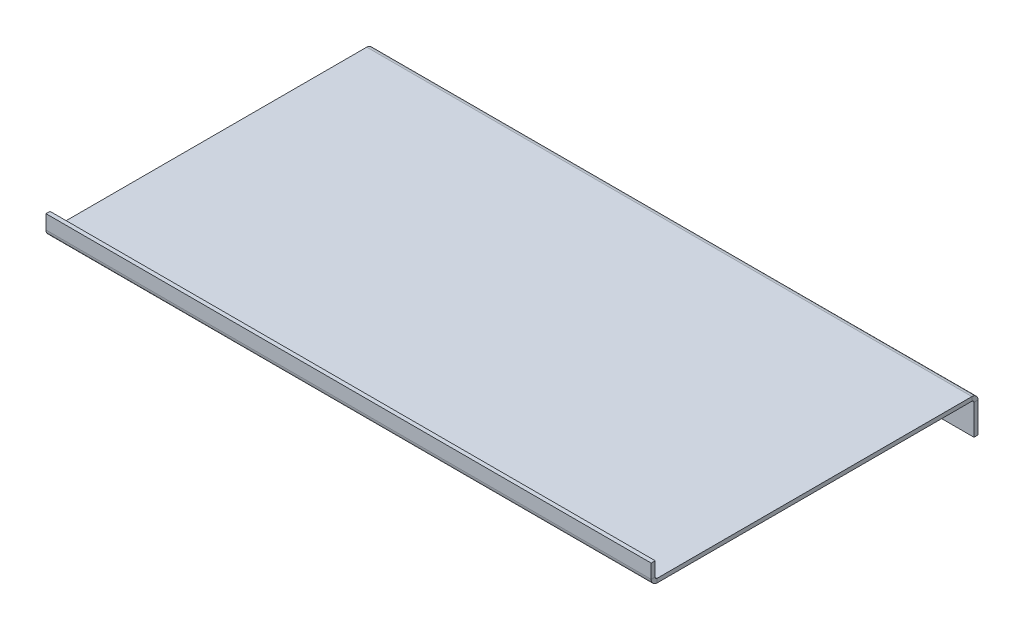
ISO-10303-21;
HEADER;
FILE_DESCRIPTION(('STEP AP214'),'2;1');
FILE_NAME('part.step','',(''),(''),'','','');
FILE_SCHEMA(('AUTOMOTIVE_DESIGN { 1 0 10303 214 1 1 1 1 }'));
ENDSEC;
DATA;
#1=APPLICATION_CONTEXT('core data for automotive mechanical design processes');
#2=APPLICATION_PROTOCOL_DEFINITION('international standard','automotive_design',2000,#1);
#3=PRODUCT_CONTEXT('',#1,'mechanical');
#4=PRODUCT('Part','Part','',(#3));
#5=PRODUCT_RELATED_PRODUCT_CATEGORY('part','',(#4));
#6=PRODUCT_DEFINITION_FORMATION('','',#4);
#7=PRODUCT_DEFINITION_CONTEXT('part definition',#1,'design');
#8=PRODUCT_DEFINITION('design','',#6,#7);
#9=PRODUCT_DEFINITION_SHAPE('','',#8);
#10=(LENGTH_UNIT() NAMED_UNIT(*) SI_UNIT(.MILLI.,.METRE.));
#11=(NAMED_UNIT(*) PLANE_ANGLE_UNIT() SI_UNIT($,.RADIAN.));
#12=(NAMED_UNIT(*) SI_UNIT($,.STERADIAN.) SOLID_ANGLE_UNIT());
#13=UNCERTAINTY_MEASURE_WITH_UNIT(LENGTH_MEASURE(1.E-05),#10,'distance_accuracy_value','');
#14=(GEOMETRIC_REPRESENTATION_CONTEXT(3) GLOBAL_UNCERTAINTY_ASSIGNED_CONTEXT((#13)) GLOBAL_UNIT_ASSIGNED_CONTEXT((#10,
#11,#12)) REPRESENTATION_CONTEXT('',''));
#15=CARTESIAN_POINT('',(0.,0.,0.));
#16=DIRECTION('',(0.,0.,1.));
#17=DIRECTION('',(1.,0.,0.));
#18=AXIS2_PLACEMENT_3D('',#15,#16,#17);
#19=CARTESIAN_POINT('',(150.,8.99999999999999,78.5));
#20=DIRECTION('',(1.,0.,0.));
#21=DIRECTION('',(0.,0.,-1.));
#22=AXIS2_PLACEMENT_3D('',#19,#20,#21);
#23=PLANE('',#22);
#24=DIRECTION('',(0.,1.,0.));
#25=VECTOR('',#24,1.);
#26=CARTESIAN_POINT('',(150.,7.99999999999999,80.));
#27=LINE('',#26,#25);
#28=CARTESIAN_POINT('',(150.,9.49999999999999,80.));
#29=VERTEX_POINT('',#28);
#30=CARTESIAN_POINT('',(150.,13.,80.));
#31=VERTEX_POINT('',#30);
#32=EDGE_CURVE('E276',#29,#31,#27,.T.);
#33=ORIENTED_EDGE('',*,*,#32,.F.);
#34=DIRECTION('',(0.,0.,-1.));
#35=VECTOR('',#34,1.);
#36=CARTESIAN_POINT('',(150.,9.49999999999999,80.));
#37=LINE('',#36,#35);
#38=CARTESIAN_POINT('',(150.,9.49999999999999,79.));
#39=VERTEX_POINT('',#38);
#40=EDGE_CURVE('E68',#29,#39,#37,.T.);
#41=ORIENTED_EDGE('',*,*,#40,.T.);
#42=DIRECTION('',(0.,1.,0.));
#43=VECTOR('',#42,1.);
#44=CARTESIAN_POINT('',(150.,7.99999999999999,79.));
#45=LINE('',#44,#43);
#46=CARTESIAN_POINT('',(150.,13.,79.));
#47=VERTEX_POINT('',#46);
#48=EDGE_CURVE('E122',#39,#47,#45,.T.);
#49=ORIENTED_EDGE('',*,*,#48,.T.);
#50=DIRECTION('',(0.,0.,-1.));
#51=VECTOR('',#50,1.);
#52=CARTESIAN_POINT('',(150.,13.,80.));
#53=LINE('',#52,#51);
#54=EDGE_CURVE('E279',#31,#47,#53,.T.);
#55=ORIENTED_EDGE('',*,*,#54,.F.);
#56=EDGE_LOOP('',(#33,#41,#49,#55));
#57=FACE_BOUND('',#56,.T.);
#58=ADVANCED_FACE('F51',(#57),#23,.T.);
#59=CARTESIAN_POINT('',(150.,13.,80.));
#60=DIRECTION('',(0.,1.,0.));
#61=DIRECTION('',(0.,0.,1.));
#62=AXIS2_PLACEMENT_3D('',#59,#60,#61);
#63=PLANE('',#62);
#64=DIRECTION('',(0.,0.,-1.));
#65=VECTOR('',#64,1.);
#66=CARTESIAN_POINT('',(0.,13.,80.));
#67=LINE('',#66,#65);
#68=CARTESIAN_POINT('',(0.,13.,80.));
#69=VERTEX_POINT('',#68);
#70=CARTESIAN_POINT('',(0.,13.,79.));
#71=VERTEX_POINT('',#70);
#72=EDGE_CURVE('E190',#69,#71,#67,.T.);
#73=ORIENTED_EDGE('',*,*,#72,.F.);
#74=DIRECTION('',(-1.,0.,0.));
#75=VECTOR('',#74,1.);
#76=CARTESIAN_POINT('',(150.,13.,80.));
#77=LINE('',#76,#75);
#78=EDGE_CURVE('E238',#31,#69,#77,.T.);
#79=ORIENTED_EDGE('',*,*,#78,.F.);
#80=ORIENTED_EDGE('',*,*,#54,.T.);
#81=DIRECTION('',(-1.,0.,0.));
#82=VECTOR('',#81,1.);
#83=CARTESIAN_POINT('',(150.,13.,79.));
#84=LINE('',#83,#82);
#85=EDGE_CURVE('E240',#47,#71,#84,.T.);
#86=ORIENTED_EDGE('',*,*,#85,.T.);
#87=EDGE_LOOP('',(#73,#79,#80,#86));
#88=FACE_BOUND('',#87,.T.);
#89=ADVANCED_FACE('F331',(#88),#63,.T.);
#90=CARTESIAN_POINT('',(0.,9.49999999999999,78.5));
#91=DIRECTION('',(1.,0.,0.));
#92=DIRECTION('',(0.,0.,-1.));
#93=AXIS2_PLACEMENT_3D('',#90,#91,#92);
#94=PLANE('',#93);
#95=DIRECTION('',(0.,1.,0.));
#96=VECTOR('',#95,1.);
#97=CARTESIAN_POINT('',(0.,7.99999999999999,79.));
#98=LINE('',#97,#96);
#99=CARTESIAN_POINT('',(0.,9.49999999999999,79.));
#100=VERTEX_POINT('',#99);
#101=EDGE_CURVE('E187',#100,#71,#98,.T.);
#102=ORIENTED_EDGE('',*,*,#101,.F.);
#103=DIRECTION('',(0.,0.,1.));
#104=VECTOR('',#103,1.);
#105=CARTESIAN_POINT('',(0.,9.49999999999999,79.));
#106=LINE('',#105,#104);
#107=CARTESIAN_POINT('',(0.,9.49999999999999,80.));
#108=VERTEX_POINT('',#107);
#109=EDGE_CURVE('E116',#100,#108,#106,.T.);
#110=ORIENTED_EDGE('',*,*,#109,.T.);
#111=DIRECTION('',(0.,1.,0.));
#112=VECTOR('',#111,1.);
#113=CARTESIAN_POINT('',(0.,7.99999999999999,80.));
#114=LINE('',#113,#112);
#115=EDGE_CURVE('E194',#108,#69,#114,.T.);
#116=ORIENTED_EDGE('',*,*,#115,.T.);
#117=ORIENTED_EDGE('',*,*,#72,.T.);
#118=EDGE_LOOP('',(#102,#110,#116,#117));
#119=FACE_BOUND('',#118,.T.);
#120=ADVANCED_FACE('F328',(#119),#94,.F.);
#121=CARTESIAN_POINT('',(150.,7.99999999999999,80.));
#122=DIRECTION('',(0.,0.,1.));
#123=DIRECTION('',(1.,0.,0.));
#124=AXIS2_PLACEMENT_3D('',#121,#122,#123);
#125=PLANE('',#124);
#126=ORIENTED_EDGE('',*,*,#115,.F.);
#127=DIRECTION('',(-1.,0.,0.));
#128=VECTOR('',#127,1.);
#129=CARTESIAN_POINT('',(150.,9.49999999999999,80.));
#130=LINE('',#129,#128);
#131=EDGE_CURVE('E235',#29,#108,#130,.T.);
#132=ORIENTED_EDGE('',*,*,#131,.F.);
#133=ORIENTED_EDGE('',*,*,#32,.T.);
#134=ORIENTED_EDGE('',*,*,#78,.T.);
#135=EDGE_LOOP('',(#126,#132,#133,#134));
#136=FACE_BOUND('',#135,.T.);
#137=ADVANCED_FACE('F333',(#136),#125,.T.);
#138=CARTESIAN_POINT('',(150.,9.49999999999999,80.));
#139=DIRECTION('',(1.,0.,0.));
#140=DIRECTION('',(0.,0.,-1.));
#141=AXIS2_PLACEMENT_3D('',#138,#139,#140);
#142=PLANE('',#141);
#143=ORIENTED_EDGE('',*,*,#40,.F.);
#144=CARTESIAN_POINT('',(150.,9.49999999999999,78.5));
#145=DIRECTION('',(1.,0.,0.));
#146=DIRECTION('',(0.,0.,-1.));
#147=AXIS2_PLACEMENT_3D('',#144,#145,#146);
#148=CIRCLE('',#147,1.5);
#149=CARTESIAN_POINT('',(150.,7.99999999999999,78.5));
#150=VERTEX_POINT('',#149);
#151=EDGE_CURVE('E273',#150,#29,#148,.F.);
#152=ORIENTED_EDGE('',*,*,#151,.F.);
#153=DIRECTION('',(0.,-1.,0.));
#154=VECTOR('',#153,1.);
#155=CARTESIAN_POINT('',(150.,8.99999999999999,78.5));
#156=LINE('',#155,#154);
#157=CARTESIAN_POINT('',(150.,8.99999999999999,78.5));
#158=VERTEX_POINT('',#157);
#159=EDGE_CURVE('E244',#158,#150,#156,.T.);
#160=ORIENTED_EDGE('',*,*,#159,.F.);
#161=CARTESIAN_POINT('',(150.,9.49999999999999,78.5));
#162=DIRECTION('',(1.,0.,0.));
#163=DIRECTION('',(0.,0.,-1.));
#164=AXIS2_PLACEMENT_3D('',#161,#162,#163);
#165=CIRCLE('',#164,0.5);
#166=EDGE_CURVE('E181',#158,#39,#165,.F.);
#167=ORIENTED_EDGE('',*,*,#166,.T.);
#168=EDGE_LOOP('',(#143,#152,#160,#167));
#169=FACE_BOUND('',#168,.T.);
#170=ADVANCED_FACE('F335',(#169),#142,.T.);
#171=CARTESIAN_POINT('',(150.,7.99999999999999,79.));
#172=DIRECTION('',(0.,0.,1.));
#173=DIRECTION('',(1.,0.,0.));
#174=AXIS2_PLACEMENT_3D('',#171,#172,#173);
#175=PLANE('',#174);
#176=ORIENTED_EDGE('',*,*,#101,.T.);
#177=ORIENTED_EDGE('',*,*,#85,.F.);
#178=ORIENTED_EDGE('',*,*,#48,.F.);
#179=DIRECTION('',(-1.,0.,0.));
#180=VECTOR('',#179,1.);
#181=CARTESIAN_POINT('',(150.,9.49999999999999,79.));
#182=LINE('',#181,#180);
#183=EDGE_CURVE('E183',#39,#100,#182,.T.);
#184=ORIENTED_EDGE('',*,*,#183,.T.);
#185=EDGE_LOOP('',(#176,#177,#178,#184));
#186=FACE_BOUND('',#185,.T.);
#187=ADVANCED_FACE('F326',(#186),#175,.F.);
#188=CARTESIAN_POINT('',(0.,7.99999999999999,78.5));
#189=DIRECTION('',(-1.,0.,0.));
#190=DIRECTION('',(0.,0.,1.));
#191=AXIS2_PLACEMENT_3D('',#188,#189,#190);
#192=PLANE('',#191);
#193=DIRECTION('',(0.,1.,0.));
#194=VECTOR('',#193,1.);
#195=CARTESIAN_POINT('',(0.,7.99999999999999,78.5));
#196=LINE('',#195,#194);
#197=CARTESIAN_POINT('',(0.,7.99999999999999,78.5));
#198=VERTEX_POINT('',#197);
#199=CARTESIAN_POINT('',(0.,8.99999999999999,78.5));
#200=VERTEX_POINT('',#199);
#201=EDGE_CURVE('E109',#198,#200,#196,.T.);
#202=ORIENTED_EDGE('',*,*,#201,.F.);
#203=CARTESIAN_POINT('',(0.,9.49999999999999,78.5));
#204=DIRECTION('',(1.,0.,0.));
#205=DIRECTION('',(0.,0.,-1.));
#206=AXIS2_PLACEMENT_3D('',#203,#204,#205);
#207=CIRCLE('',#206,1.5);
#208=EDGE_CURVE('E197',#198,#108,#207,.F.);
#209=ORIENTED_EDGE('',*,*,#208,.T.);
#210=ORIENTED_EDGE('',*,*,#109,.F.);
#211=CARTESIAN_POINT('',(0.,9.49999999999999,78.5));
#212=DIRECTION('',(1.,0.,0.));
#213=DIRECTION('',(0.,0.,-1.));
#214=AXIS2_PLACEMENT_3D('',#211,#212,#213);
#215=CIRCLE('',#214,0.5);
#216=EDGE_CURVE('E216',#200,#100,#215,.F.);
#217=ORIENTED_EDGE('',*,*,#216,.F.);
#218=EDGE_LOOP('',(#202,#209,#210,#217));
#219=FACE_BOUND('',#218,.T.);
#220=ADVANCED_FACE('F320',(#219),#192,.T.);
#221=CARTESIAN_POINT('',(150.,9.49999999999999,78.5));
#222=DIRECTION('',(-1.,0.,0.));
#223=DIRECTION('',(0.,0.,1.));
#224=AXIS2_PLACEMENT_3D('',#221,#222,#223);
#225=CYLINDRICAL_SURFACE('',#224,1.5);
#226=ORIENTED_EDGE('',*,*,#208,.F.);
#227=DIRECTION('',(-1.,0.,0.));
#228=VECTOR('',#227,1.);
#229=CARTESIAN_POINT('',(150.,7.99999999999999,78.5));
#230=LINE('',#229,#228);
#231=EDGE_CURVE('E232',#150,#198,#230,.T.);
#232=ORIENTED_EDGE('',*,*,#231,.F.);
#233=ORIENTED_EDGE('',*,*,#151,.T.);
#234=ORIENTED_EDGE('',*,*,#131,.T.);
#235=EDGE_LOOP('',(#226,#232,#233,#234));
#236=FACE_BOUND('',#235,.T.);
#237=ADVANCED_FACE('F317',(#236),#225,.T.);
#238=CARTESIAN_POINT('',(150.,7.5,-1.));
#239=DIRECTION('',(1.,0.,0.));
#240=DIRECTION('',(0.,0.,-1.));
#241=AXIS2_PLACEMENT_3D('',#238,#239,#240);
#242=PLANE('',#241);
#243=DIRECTION('',(0.,0.,1.));
#244=VECTOR('',#243,1.);
#245=CARTESIAN_POINT('',(150.,8.,0.));
#246=LINE('',#245,#244);
#247=CARTESIAN_POINT('',(150.,8.,0.5));
#248=VERTEX_POINT('',#247);
#249=EDGE_CURVE('E155',#248,#150,#246,.T.);
#250=ORIENTED_EDGE('',*,*,#249,.F.);
#251=DIRECTION('',(0.,1.,0.));
#252=VECTOR('',#251,1.);
#253=CARTESIAN_POINT('',(150.,8.,0.5));
#254=LINE('',#253,#252);
#255=CARTESIAN_POINT('',(150.,9.,0.5));
#256=VERTEX_POINT('',#255);
#257=EDGE_CURVE('E11',#248,#256,#254,.T.);
#258=ORIENTED_EDGE('',*,*,#257,.T.);
#259=DIRECTION('',(0.,0.,1.));
#260=VECTOR('',#259,1.);
#261=CARTESIAN_POINT('',(150.,9.,0.));
#262=LINE('',#261,#260);
#263=EDGE_CURVE('E152',#256,#158,#262,.T.);
#264=ORIENTED_EDGE('',*,*,#263,.T.);
#265=ORIENTED_EDGE('',*,*,#159,.T.);
#266=EDGE_LOOP('',(#250,#258,#264,#265));
#267=FACE_BOUND('',#266,.T.);
#268=ADVANCED_FACE('F150',(#267),#242,.T.);
#269=CARTESIAN_POINT('',(150.,9.49999999999999,78.5));
#270=DIRECTION('',(-1.,0.,0.));
#271=DIRECTION('',(0.,0.,1.));
#272=AXIS2_PLACEMENT_3D('',#269,#270,#271);
#273=CYLINDRICAL_SURFACE('',#272,0.5);
#274=ORIENTED_EDGE('',*,*,#216,.T.);
#275=ORIENTED_EDGE('',*,*,#183,.F.);
#276=ORIENTED_EDGE('',*,*,#166,.F.);
#277=DIRECTION('',(-1.,0.,0.));
#278=VECTOR('',#277,1.);
#279=CARTESIAN_POINT('',(150.,8.99999999999999,78.5));
#280=LINE('',#279,#278);
#281=EDGE_CURVE('E176',#158,#200,#280,.T.);
#282=ORIENTED_EDGE('',*,*,#281,.T.);
#283=EDGE_LOOP('',(#274,#275,#276,#282));
#284=FACE_BOUND('',#283,.T.);
#285=ADVANCED_FACE('F323',(#284),#273,.F.);
#286=CARTESIAN_POINT('',(0.,9.49999999999999,79.));
#287=DIRECTION('',(-1.,0.,0.));
#288=DIRECTION('',(0.,0.,1.));
#289=AXIS2_PLACEMENT_3D('',#286,#287,#288);
#290=PLANE('',#289);
#291=DIRECTION('',(0.,0.,1.));
#292=VECTOR('',#291,1.);
#293=CARTESIAN_POINT('',(0.,8.,0.));
#294=LINE('',#293,#292);
#295=CARTESIAN_POINT('',(0.,8.,0.5));
#296=VERTEX_POINT('',#295);
#297=EDGE_CURVE('E199',#296,#198,#294,.T.);
#298=ORIENTED_EDGE('',*,*,#297,.T.);
#299=ORIENTED_EDGE('',*,*,#201,.T.);
#300=DIRECTION('',(0.,0.,1.));
#301=VECTOR('',#300,1.);
#302=CARTESIAN_POINT('',(0.,9.,0.));
#303=LINE('',#302,#301);
#304=CARTESIAN_POINT('',(0.,9.,0.5));
#305=VERTEX_POINT('',#304);
#306=EDGE_CURVE('E214',#305,#200,#303,.T.);
#307=ORIENTED_EDGE('',*,*,#306,.F.);
#308=DIRECTION('',(0.,-1.,0.));
#309=VECTOR('',#308,1.);
#310=CARTESIAN_POINT('',(0.,9.,0.5));
#311=LINE('',#310,#309);
#312=EDGE_CURVE('E247',#305,#296,#311,.T.);
#313=ORIENTED_EDGE('',*,*,#312,.T.);
#314=EDGE_LOOP('',(#298,#299,#307,#313));
#315=FACE_BOUND('',#314,.T.);
#316=ADVANCED_FACE('F309',(#315),#290,.T.);
#317=CARTESIAN_POINT('',(150.,8.,0.));
#318=DIRECTION('',(0.,-1.,0.));
#319=DIRECTION('',(0.,0.,-1.));
#320=AXIS2_PLACEMENT_3D('',#317,#318,#319);
#321=PLANE('',#320);
#322=ORIENTED_EDGE('',*,*,#297,.F.);
#323=DIRECTION('',(-1.,0.,0.));
#324=VECTOR('',#323,1.);
#325=CARTESIAN_POINT('',(150.,8.,0.5));
#326=LINE('',#325,#324);
#327=EDGE_CURVE('E229',#248,#296,#326,.T.);
#328=ORIENTED_EDGE('',*,*,#327,.F.);
#329=ORIENTED_EDGE('',*,*,#249,.T.);
#330=ORIENTED_EDGE('',*,*,#231,.T.);
#331=EDGE_LOOP('',(#322,#328,#329,#330));
#332=FACE_BOUND('',#331,.T.);
#333=ADVANCED_FACE('F312',(#332),#321,.T.);
#334=CARTESIAN_POINT('',(150.,8.,0.5));
#335=DIRECTION('',(1.,0.,0.));
#336=DIRECTION('',(0.,0.,-1.));
#337=AXIS2_PLACEMENT_3D('',#334,#335,#336);
#338=PLANE('',#337);
#339=ORIENTED_EDGE('',*,*,#257,.F.);
#340=CARTESIAN_POINT('',(150.,7.5,0.5));
#341=DIRECTION('',(-1.,0.,0.));
#342=DIRECTION('',(0.,0.,1.));
#343=AXIS2_PLACEMENT_3D('',#340,#341,#342);
#344=CIRCLE('',#343,0.5);
#345=CARTESIAN_POINT('',(150.,7.5,0.));
#346=VERTEX_POINT('',#345);
#347=EDGE_CURVE('E263',#346,#248,#344,.F.);
#348=ORIENTED_EDGE('',*,*,#347,.F.);
#349=DIRECTION('',(0.,0.,1.));
#350=VECTOR('',#349,1.);
#351=CARTESIAN_POINT('',(150.,7.5,-1.));
#352=LINE('',#351,#350);
#353=CARTESIAN_POINT('',(150.,7.5,-1.));
#354=VERTEX_POINT('',#353);
#355=EDGE_CURVE('E60',#354,#346,#352,.T.);
#356=ORIENTED_EDGE('',*,*,#355,.F.);
#357=CARTESIAN_POINT('',(150.,7.5,0.5));
#358=DIRECTION('',(1.,0.,0.));
#359=DIRECTION('',(0.,0.,-1.));
#360=AXIS2_PLACEMENT_3D('',#357,#358,#359);
#361=CIRCLE('',#360,1.5);
#362=EDGE_CURVE('E161',#354,#256,#361,.T.);
#363=ORIENTED_EDGE('',*,*,#362,.T.);
#364=EDGE_LOOP('',(#339,#348,#356,#363));
#365=FACE_BOUND('',#364,.T.);
#366=ADVANCED_FACE('F53',(#365),#338,.T.);
#367=CARTESIAN_POINT('',(150.,9.,0.));
#368=DIRECTION('',(0.,-1.,0.));
#369=DIRECTION('',(0.,0.,-1.));
#370=AXIS2_PLACEMENT_3D('',#367,#368,#369);
#371=PLANE('',#370);
#372=ORIENTED_EDGE('',*,*,#306,.T.);
#373=ORIENTED_EDGE('',*,*,#281,.F.);
#374=ORIENTED_EDGE('',*,*,#263,.F.);
#375=DIRECTION('',(-1.,0.,0.));
#376=VECTOR('',#375,1.);
#377=CARTESIAN_POINT('',(150.,9.,0.5));
#378=LINE('',#377,#376);
#379=EDGE_CURVE('E170',#256,#305,#378,.T.);
#380=ORIENTED_EDGE('',*,*,#379,.T.);
#381=EDGE_LOOP('',(#372,#373,#374,#380));
#382=FACE_BOUND('',#381,.T.);
#383=ADVANCED_FACE('F178',(#382),#371,.F.);
#384=CARTESIAN_POINT('',(0.,7.5,0.));
#385=DIRECTION('',(-1.,0.,0.));
#386=DIRECTION('',(0.,0.,1.));
#387=AXIS2_PLACEMENT_3D('',#384,#385,#386);
#388=PLANE('',#387);
#389=DIRECTION('',(0.,0.,-1.));
#390=VECTOR('',#389,1.);
#391=CARTESIAN_POINT('',(0.,7.5,0.));
#392=LINE('',#391,#390);
#393=CARTESIAN_POINT('',(0.,7.5,0.));
#394=VERTEX_POINT('',#393);
#395=CARTESIAN_POINT('',(0.,7.5,-1.));
#396=VERTEX_POINT('',#395);
#397=EDGE_CURVE('E249',#394,#396,#392,.T.);
#398=ORIENTED_EDGE('',*,*,#397,.F.);
#399=CARTESIAN_POINT('',(0.,7.5,0.5));
#400=DIRECTION('',(-1.,0.,0.));
#401=DIRECTION('',(0.,0.,1.));
#402=AXIS2_PLACEMENT_3D('',#399,#400,#401);
#403=CIRCLE('',#402,0.5);
#404=EDGE_CURVE('E201',#394,#296,#403,.F.);
#405=ORIENTED_EDGE('',*,*,#404,.T.);
#406=ORIENTED_EDGE('',*,*,#312,.F.);
#407=CARTESIAN_POINT('',(0.,7.5,0.5));
#408=DIRECTION('',(1.,0.,0.));
#409=DIRECTION('',(0.,0.,-1.));
#410=AXIS2_PLACEMENT_3D('',#407,#408,#409);
#411=CIRCLE('',#410,1.5);
#412=EDGE_CURVE('E173',#396,#305,#411,.T.);
#413=ORIENTED_EDGE('',*,*,#412,.F.);
#414=EDGE_LOOP('',(#398,#405,#406,#413));
#415=FACE_BOUND('',#414,.T.);
#416=ADVANCED_FACE('F308',(#415),#388,.T.);
#417=CARTESIAN_POINT('',(150.,7.5,0.5));
#418=DIRECTION('',(-1.,0.,0.));
#419=DIRECTION('',(0.,0.,1.));
#420=AXIS2_PLACEMENT_3D('',#417,#418,#419);
#421=CYLINDRICAL_SURFACE('',#420,0.5);
#422=ORIENTED_EDGE('',*,*,#404,.F.);
#423=DIRECTION('',(-1.,0.,0.));
#424=VECTOR('',#423,1.);
#425=CARTESIAN_POINT('',(150.,7.5,0.));
#426=LINE('',#425,#424);
#427=EDGE_CURVE('E226',#346,#394,#426,.T.);
#428=ORIENTED_EDGE('',*,*,#427,.F.);
#429=ORIENTED_EDGE('',*,*,#347,.T.);
#430=ORIENTED_EDGE('',*,*,#327,.T.);
#431=EDGE_LOOP('',(#422,#428,#429,#430));
#432=FACE_BOUND('',#431,.T.);
#433=ADVANCED_FACE('F262',(#432),#421,.F.);
#434=CARTESIAN_POINT('',(150.,0.,-1.));
#435=DIRECTION('',(0.,-1.,0.));
#436=DIRECTION('',(0.,0.,-1.));
#437=AXIS2_PLACEMENT_3D('',#434,#435,#436);
#438=PLANE('',#437);
#439=DIRECTION('',(0.,0.,1.));
#440=VECTOR('',#439,1.);
#441=CARTESIAN_POINT('',(0.,0.,-1.));
#442=LINE('',#441,#440);
#443=CARTESIAN_POINT('',(0.,0.,-1.));
#444=VERTEX_POINT('',#443);
#445=CARTESIAN_POINT('',(0.,0.,0.));
#446=VERTEX_POINT('',#445);
#447=EDGE_CURVE('E207',#444,#446,#442,.T.);
#448=ORIENTED_EDGE('',*,*,#447,.F.);
#449=DIRECTION('',(-1.,0.,0.));
#450=VECTOR('',#449,1.);
#451=CARTESIAN_POINT('',(150.,0.,-1.));
#452=LINE('',#451,#450);
#453=CARTESIAN_POINT('',(150.,0.,-1.));
#454=VERTEX_POINT('',#453);
#455=EDGE_CURVE('E222',#454,#444,#452,.T.);
#456=ORIENTED_EDGE('',*,*,#455,.F.);
#457=DIRECTION('',(0.,0.,1.));
#458=VECTOR('',#457,1.);
#459=CARTESIAN_POINT('',(150.,0.,-1.));
#460=LINE('',#459,#458);
#461=CARTESIAN_POINT('',(150.,0.,0.));
#462=VERTEX_POINT('',#461);
#463=EDGE_CURVE('E268',#454,#462,#460,.T.);
#464=ORIENTED_EDGE('',*,*,#463,.T.);
#465=DIRECTION('',(-1.,0.,0.));
#466=VECTOR('',#465,1.);
#467=CARTESIAN_POINT('',(150.,0.,0.));
#468=LINE('',#467,#466);
#469=EDGE_CURVE('E224',#462,#446,#468,.T.);
#470=ORIENTED_EDGE('',*,*,#469,.T.);
#471=EDGE_LOOP('',(#448,#456,#464,#470));
#472=FACE_BOUND('',#471,.T.);
#473=ADVANCED_FACE('F384',(#472),#438,.T.);
#474=CARTESIAN_POINT('',(150.,9.49999999999999,78.5));
#475=DIRECTION('',(1.,0.,0.));
#476=DIRECTION('',(0.,0.,-1.));
#477=AXIS2_PLACEMENT_3D('',#474,#475,#476);
#478=PLANE('',#477);
#479=DIRECTION('',(0.,1.,0.));
#480=VECTOR('',#479,1.);
#481=CARTESIAN_POINT('',(150.,0.,-1.));
#482=LINE('',#481,#480);
#483=EDGE_CURVE('E166',#454,#354,#482,.T.);
#484=ORIENTED_EDGE('',*,*,#483,.T.);
#485=ORIENTED_EDGE('',*,*,#355,.T.);
#486=DIRECTION('',(0.,1.,0.));
#487=VECTOR('',#486,1.);
#488=CARTESIAN_POINT('',(150.,0.,0.));
#489=LINE('',#488,#487);
#490=EDGE_CURVE('E256',#462,#346,#489,.T.);
#491=ORIENTED_EDGE('',*,*,#490,.F.);
#492=ORIENTED_EDGE('',*,*,#463,.F.);
#493=EDGE_LOOP('',(#484,#485,#491,#492));
#494=FACE_BOUND('',#493,.T.);
#495=ADVANCED_FACE('F253',(#494),#478,.T.);
#496=CARTESIAN_POINT('',(150.,7.5,0.5));
#497=DIRECTION('',(-1.,0.,0.));
#498=DIRECTION('',(0.,0.,1.));
#499=AXIS2_PLACEMENT_3D('',#496,#497,#498);
#500=CYLINDRICAL_SURFACE('',#499,1.5);
#501=ORIENTED_EDGE('',*,*,#412,.T.);
#502=ORIENTED_EDGE('',*,*,#379,.F.);
#503=ORIENTED_EDGE('',*,*,#362,.F.);
#504=DIRECTION('',(-1.,0.,0.));
#505=VECTOR('',#504,1.);
#506=CARTESIAN_POINT('',(150.,7.5,-1.));
#507=LINE('',#506,#505);
#508=EDGE_CURVE('E175',#354,#396,#507,.T.);
#509=ORIENTED_EDGE('',*,*,#508,.T.);
#510=EDGE_LOOP('',(#501,#502,#503,#509));
#511=FACE_BOUND('',#510,.T.);
#512=ADVANCED_FACE('F171',(#511),#500,.T.);
#513=CARTESIAN_POINT('',(0.,9.,0.5));
#514=DIRECTION('',(-1.,0.,0.));
#515=DIRECTION('',(0.,0.,1.));
#516=AXIS2_PLACEMENT_3D('',#513,#514,#515);
#517=PLANE('',#516);
#518=DIRECTION('',(0.,1.,0.));
#519=VECTOR('',#518,1.);
#520=CARTESIAN_POINT('',(0.,0.,0.));
#521=LINE('',#520,#519);
#522=EDGE_CURVE('E204',#446,#394,#521,.T.);
#523=ORIENTED_EDGE('',*,*,#522,.T.);
#524=ORIENTED_EDGE('',*,*,#397,.T.);
#525=DIRECTION('',(0.,1.,0.));
#526=VECTOR('',#525,1.);
#527=CARTESIAN_POINT('',(0.,0.,-1.));
#528=LINE('',#527,#526);
#529=EDGE_CURVE('E210',#444,#396,#528,.T.);
#530=ORIENTED_EDGE('',*,*,#529,.F.);
#531=ORIENTED_EDGE('',*,*,#447,.T.);
#532=EDGE_LOOP('',(#523,#524,#530,#531));
#533=FACE_BOUND('',#532,.T.);
#534=ADVANCED_FACE('F300',(#533),#517,.T.);
#535=CARTESIAN_POINT('',(150.,0.,-1.));
#536=DIRECTION('',(0.,0.,1.));
#537=DIRECTION('',(1.,0.,0.));
#538=AXIS2_PLACEMENT_3D('',#535,#536,#537);
#539=PLANE('',#538);
#540=CARTESIAN_POINT('',(25.,3.75,-1.));
#541=DIRECTION('',(0.,0.,-1.));
#542=DIRECTION('',(-1.,0.,0.));
#543=AXIS2_PLACEMENT_3D('',#540,#541,#542);
#544=CIRCLE('',#543,1.25);
#545=CARTESIAN_POINT('',(23.75,3.75,-1.));
#546=VERTEX_POINT('',#545);
#547=EDGE_CURVE('E288',#546,#546,#544,.T.);
#548=ORIENTED_EDGE('',*,*,#547,.F.);
#549=EDGE_LOOP('',(#548));
#550=FACE_BOUND('',#549,.T.);
#551=CARTESIAN_POINT('',(125.,3.74999999999998,-1.));
#552=DIRECTION('',(0.,0.,-1.));
#553=DIRECTION('',(-1.,0.,0.));
#554=AXIS2_PLACEMENT_3D('',#551,#552,#553);
#555=CIRCLE('',#554,1.25000000000001);
#556=CARTESIAN_POINT('',(123.75,3.74999999999998,-1.));
#557=VERTEX_POINT('',#556);
#558=EDGE_CURVE('E289',#557,#557,#555,.T.);
#559=ORIENTED_EDGE('',*,*,#558,.F.);
#560=EDGE_LOOP('',(#559));
#561=FACE_BOUND('',#560,.T.);
#562=ORIENTED_EDGE('',*,*,#529,.T.);
#563=ORIENTED_EDGE('',*,*,#508,.F.);
#564=ORIENTED_EDGE('',*,*,#483,.F.);
#565=ORIENTED_EDGE('',*,*,#455,.T.);
#566=EDGE_LOOP('',(#562,#563,#564,#565));
#567=FACE_BOUND('',#566,.T.);
#568=ADVANCED_FACE('F297',(#550,#561,#567),#539,.F.);
#569=CARTESIAN_POINT('',(150.,0.,0.));
#570=DIRECTION('',(0.,0.,1.));
#571=DIRECTION('',(1.,0.,0.));
#572=AXIS2_PLACEMENT_3D('',#569,#570,#571);
#573=PLANE('',#572);
#574=CARTESIAN_POINT('',(25.,3.75,0.));
#575=DIRECTION('',(0.,0.,1.));
#576=DIRECTION('',(1.,0.,0.));
#577=AXIS2_PLACEMENT_3D('',#574,#575,#576);
#578=CIRCLE('',#577,1.25);
#579=CARTESIAN_POINT('',(26.25,3.75,0.));
#580=VERTEX_POINT('',#579);
#581=EDGE_CURVE('E191',#580,#580,#578,.T.);
#582=ORIENTED_EDGE('',*,*,#581,.F.);
#583=EDGE_LOOP('',(#582));
#584=FACE_BOUND('',#583,.T.);
#585=CARTESIAN_POINT('',(125.,3.74999999999998,0.));
#586=DIRECTION('',(0.,0.,1.));
#587=DIRECTION('',(1.,0.,0.));
#588=AXIS2_PLACEMENT_3D('',#585,#586,#587);
#589=CIRCLE('',#588,1.25000000000001);
#590=CARTESIAN_POINT('',(126.25,3.74999999999998,0.));
#591=VERTEX_POINT('',#590);
#592=EDGE_CURVE('E285',#591,#591,#589,.T.);
#593=ORIENTED_EDGE('',*,*,#592,.F.);
#594=EDGE_LOOP('',(#593));
#595=FACE_BOUND('',#594,.T.);
#596=ORIENTED_EDGE('',*,*,#522,.F.);
#597=ORIENTED_EDGE('',*,*,#469,.F.);
#598=ORIENTED_EDGE('',*,*,#490,.T.);
#599=ORIENTED_EDGE('',*,*,#427,.T.);
#600=EDGE_LOOP('',(#596,#597,#598,#599));
#601=FACE_BOUND('',#600,.T.);
#602=ADVANCED_FACE('F267',(#584,#595,#601),#573,.T.);
#603=CARTESIAN_POINT('',(25.,3.75,9.));
#604=DIRECTION('',(0.,0.,-1.));
#605=DIRECTION('',(-1.,0.,0.));
#606=AXIS2_PLACEMENT_3D('',#603,#604,#605);
#607=CYLINDRICAL_SURFACE('',#606,1.25);
#608=ORIENTED_EDGE('',*,*,#581,.T.);
#609=EDGE_LOOP('',(#608));
#610=FACE_BOUND('',#609,.T.);
#611=ORIENTED_EDGE('',*,*,#547,.T.);
#612=EDGE_LOOP('',(#611));
#613=FACE_BOUND('',#612,.T.);
#614=ADVANCED_FACE('F295',(#610,#613),#607,.F.);
#615=CARTESIAN_POINT('',(125.,3.74999999999998,9.));
#616=DIRECTION('',(0.,0.,-1.));
#617=DIRECTION('',(-1.,0.,0.));
#618=AXIS2_PLACEMENT_3D('',#615,#616,#617);
#619=CYLINDRICAL_SURFACE('',#618,1.25000000000001);
#620=ORIENTED_EDGE('',*,*,#592,.T.);
#621=EDGE_LOOP('',(#620));
#622=FACE_BOUND('',#621,.T.);
#623=ORIENTED_EDGE('',*,*,#558,.T.);
#624=EDGE_LOOP('',(#623));
#625=FACE_BOUND('',#624,.T.);
#626=ADVANCED_FACE('F349',(#622,#625),#619,.F.);
#627=CLOSED_SHELL('',(#58,#89,#120,#137,#170,#187,#220,#237,#268,#285,#316,#333,#366,#383,#416,
#433,#473,#495,#512,#534,#568,#602,#614,#626));
#628=MANIFOLD_SOLID_BREP('B2',#627);
#629=ADVANCED_BREP_SHAPE_REPRESENTATION('',(#18,#628),#14);
#630=SHAPE_DEFINITION_REPRESENTATION(#9,#629);
ENDSEC;
END-ISO-10303-21;
